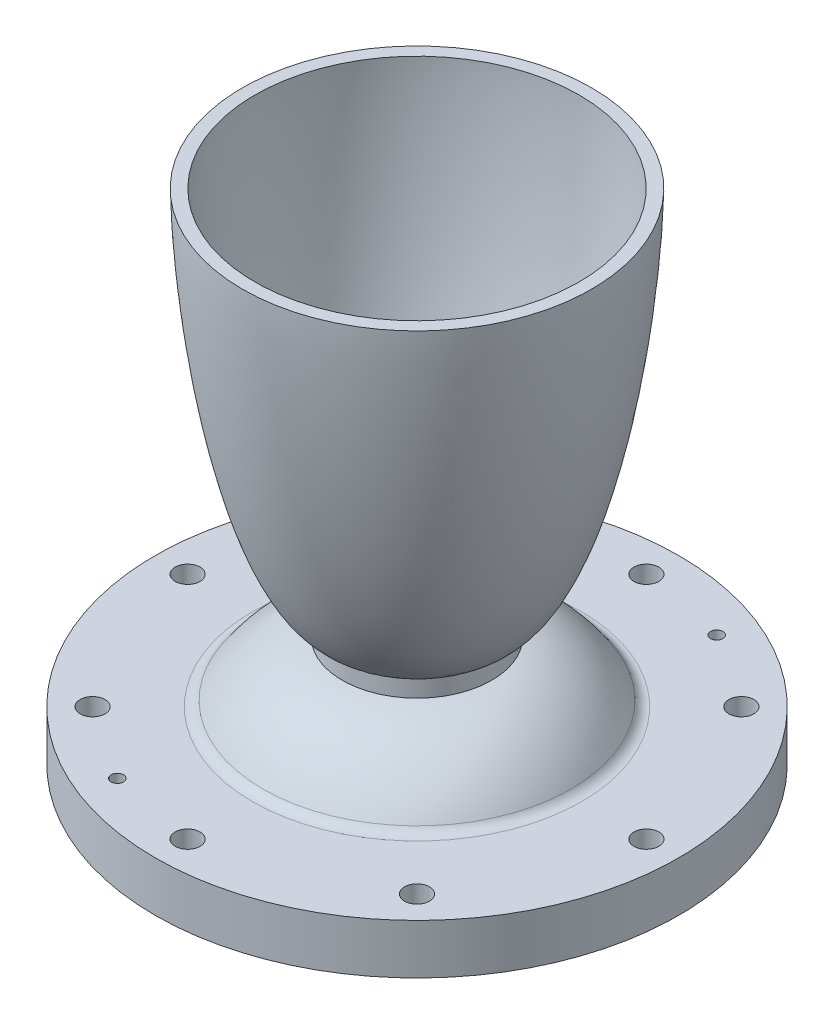
ISO-10303-21;
HEADER;
FILE_DESCRIPTION(('STEP AP214'),'2;1');
FILE_NAME('part.step','',(''),(''),'','','');
FILE_SCHEMA(('AUTOMOTIVE_DESIGN { 1 0 10303 214 1 1 1 1 }'));
ENDSEC;
DATA;
#1=APPLICATION_CONTEXT('core data for automotive mechanical design processes');
#2=APPLICATION_PROTOCOL_DEFINITION('international standard','automotive_design',2000,#1);
#3=PRODUCT_CONTEXT('',#1,'mechanical');
#4=PRODUCT('Part','Part','',(#3));
#5=PRODUCT_RELATED_PRODUCT_CATEGORY('part','',(#4));
#6=PRODUCT_DEFINITION_FORMATION('','',#4);
#7=PRODUCT_DEFINITION_CONTEXT('part definition',#1,'design');
#8=PRODUCT_DEFINITION('design','',#6,#7);
#9=PRODUCT_DEFINITION_SHAPE('','',#8);
#10=(LENGTH_UNIT() NAMED_UNIT(*) SI_UNIT(.MILLI.,.METRE.));
#11=(NAMED_UNIT(*) PLANE_ANGLE_UNIT() SI_UNIT($,.RADIAN.));
#12=(NAMED_UNIT(*) SI_UNIT($,.STERADIAN.) SOLID_ANGLE_UNIT());
#13=UNCERTAINTY_MEASURE_WITH_UNIT(LENGTH_MEASURE(1.E-05),#10,'distance_accuracy_value','');
#14=(GEOMETRIC_REPRESENTATION_CONTEXT(3) GLOBAL_UNCERTAINTY_ASSIGNED_CONTEXT((#13)) GLOBAL_UNIT_ASSIGNED_CONTEXT((#10,
#11,#12)) REPRESENTATION_CONTEXT('',''));
#15=CARTESIAN_POINT('',(0.,0.,0.));
#16=DIRECTION('',(0.,0.,1.));
#17=DIRECTION('',(1.,0.,0.));
#18=AXIS2_PLACEMENT_3D('',#15,#16,#17);
#19=CARTESIAN_POINT('',(0.,29.8542641397743,0.));
#20=DIRECTION('',(0.,-1.,0.));
#21=DIRECTION('',(0.,0.,-1.));
#22=AXIS2_PLACEMENT_3D('',#19,#20,#21);
#23=TOROIDAL_SURFACE('',#22,14.2803848547379,4.7625);
#24=CARTESIAN_POINT('',(0.,29.8542641397743,0.));
#25=DIRECTION('',(0.,-1.,0.));
#26=DIRECTION('',(0.,0.,-1.));
#27=AXIS2_PLACEMENT_3D('',#24,#25,#26);
#28=CIRCLE('',#27,9.51788485473788);
#29=CARTESIAN_POINT('',(0.,29.8542641397743,-9.51788485473788));
#30=VERTEX_POINT('',#29);
#31=EDGE_CURVE('E110',#30,#30,#28,.T.);
#32=ORIENTED_EDGE('',*,*,#31,.F.);
#33=EDGE_LOOP('',(#32));
#34=FACE_BOUND('',#33,.T.);
#35=CARTESIAN_POINT('',(0.,25.1315262063773,0.));
#36=DIRECTION('',(0.,-1.,0.));
#37=DIRECTION('',(0.,0.,-1.));
#38=AXIS2_PLACEMENT_3D('',#35,#36,#37);
#39=CIRCLE('',#38,13.666257288323);
#40=CARTESIAN_POINT('',(0.,25.1315262063773,-13.666257288323));
#41=VERTEX_POINT('',#40);
#42=EDGE_CURVE('E44',#41,#41,#39,.T.);
#43=ORIENTED_EDGE('',*,*,#42,.T.);
#44=EDGE_LOOP('',(#43));
#45=FACE_BOUND('',#44,.T.);
#46=ADVANCED_FACE('F31',(#34,#45),#23,.T.);
#47=CARTESIAN_POINT('',(-41.275,0.,0.));
#48=CARTESIAN_POINT('',(-41.2740482695217,0.0486337324386472,0.));
#49=CARTESIAN_POINT('',(-41.2702658160628,0.145822286289916,0.));
#50=CARTESIAN_POINT('',(-41.2498864286849,0.42069805070654,0.));
#51=CARTESIAN_POINT('',(-41.1844545380993,0.952068232417223,0.));
#52=CARTESIAN_POINT('',(-41.0456972319703,1.71822600495707,0.));
#53=CARTESIAN_POINT('',(-40.8030503882331,2.71061582436616,0.));
#54=CARTESIAN_POINT('',(-40.4713595142758,3.79591999168736,0.));
#55=CARTESIAN_POINT('',(-40.0738634411657,4.89282909417258,0.));
#56=CARTESIAN_POINT('',(-39.5825067896802,6.07481266261933,0.));
#57=CARTESIAN_POINT('',(-38.9093304891603,7.49520986042452,0.));
#58=CARTESIAN_POINT('',(-38.0131760324094,9.12980259281523,0.));
#59=CARTESIAN_POINT('',(-36.8509904587546,10.9460362971627,0.));
#60=CARTESIAN_POINT('',(-35.4547421274325,12.8169212480345,0.));
#61=CARTESIAN_POINT('',(-33.9314392187202,14.585782904275,0.));
#62=CARTESIAN_POINT('',(-32.2903839047085,16.2459191467967,0.));
#63=CARTESIAN_POINT('',(-30.5400711601419,17.790421622529,0.));
#64=CARTESIAN_POINT('',(-28.6887326358713,19.2122512067634,0.));
#65=CARTESIAN_POINT('',(-26.7445757643625,20.5043436040328,0.));
#66=CARTESIAN_POINT('',(-24.7162091347765,21.6597343307254,0.));
#67=CARTESIAN_POINT('',(-22.6125023398444,22.6717097728236,0.));
#68=CARTESIAN_POINT('',(-20.4432201113575,23.5339726344523,0.));
#69=CARTESIAN_POINT('',(-18.4962933476153,24.1524674664259,0.));
#70=CARTESIAN_POINT('',(-16.7998864552001,24.5823991503031,0.));
#71=CARTESIAN_POINT('',(-15.5134432636415,24.8436085254731,0.));
#72=CARTESIAN_POINT('',(-14.6581957403054,24.990901268989,0.));
#73=CARTESIAN_POINT('',(-14.0864515766681,25.0751975202173,0.));
#74=CARTESIAN_POINT('',(-13.8044042990146,25.1135620744107,0.));
#75=CARTESIAN_POINT('',(-13.666257288323,25.1315262063773,0.));
#76=B_SPLINE_CURVE_WITH_KNOTS('',4,(#47,#48,#49,#50,#51,#52,#53,#54,#55,#56,#57,#58,#59,#60,#61,
#62,#63,#64,#65,#66,#67,#68,#69,#70,#71,#72,#73,#74,#75),.UNSPECIFIED.,.F.,.F.,(5,1,1,1,1,1,1,1,
1,1,1,1,1,1,1,1,1,1,1,1,1,1,1,1,1,5),(0.,0.00401484909608226,0.00802969819216452,
0.0227470961228314,0.0441777122776176,0.0682473660350328,0.0923169269059589,0.116386462642345,
0.140456137271166,0.173883836801443,0.222022893633605,0.270162138141272,0.31830113459759,
0.366440286525089,0.414579370063091,0.462718532534819,0.510857613485277,0.558996754784725,
0.607135853792004,0.655274937644816,0.703414058846366,0.751553161907756,0.775622711242062,
0.799692260576367,0.811727036760595,0.823244081799249),.UNSPECIFIED.);
#77=CARTESIAN_POINT('',(0.,0.,0.));
#78=DIRECTION('',(0.,-1.,0.));
#79=AXIS1_PLACEMENT('',#77,#78);
#80=SURFACE_OF_REVOLUTION('',#76,#79);
#81=ORIENTED_EDGE('',*,*,#42,.F.);
#82=EDGE_LOOP('',(#81));
#83=FACE_BOUND('',#82,.T.);
#84=CARTESIAN_POINT('',(0.,0.,0.));
#85=DIRECTION('',(0.,-1.,0.));
#86=DIRECTION('',(0.,0.,-1.));
#87=AXIS2_PLACEMENT_3D('',#84,#85,#86);
#88=CIRCLE('',#87,41.275);
#89=CARTESIAN_POINT('',(0.,0.,-41.275));
#90=VERTEX_POINT('',#89);
#91=EDGE_CURVE('E177',#90,#90,#88,.T.);
#92=ORIENTED_EDGE('',*,*,#91,.T.);
#93=EDGE_LOOP('',(#92));
#94=FACE_BOUND('',#93,.T.);
#95=ADVANCED_FACE('F163',(#83,#94),#80,.T.);
#96=CARTESIAN_POINT('',(-41.275,0.,0.));
#97=DIRECTION('',(0.,1.,0.));
#98=DIRECTION('',(0.,0.,1.));
#99=AXIS2_PLACEMENT_3D('',#96,#97,#98);
#100=PLANE('',#99);
#101=CARTESIAN_POINT('',(22.3563661187686,0.,-53.9730422893094));
#102=DIRECTION('',(0.,-1.,0.));
#103=DIRECTION('',(0.,0.,-1.));
#104=AXIS2_PLACEMENT_3D('',#101,#102,#103);
#105=CIRCLE('',#104,3.17500000000001);
#106=CARTESIAN_POINT('',(22.3563661187686,0.,-57.1480422893094));
#107=VERTEX_POINT('',#106);
#108=EDGE_CURVE('E278',#107,#107,#105,.T.);
#109=ORIENTED_EDGE('',*,*,#108,.F.);
#110=EDGE_LOOP('',(#109));
#111=FACE_BOUND('',#110,.T.);
#112=CARTESIAN_POINT('',(-22.3563661187682,0.,53.9730422893095));
#113=DIRECTION('',(0.,-1.,0.));
#114=DIRECTION('',(0.,0.,-1.));
#115=AXIS2_PLACEMENT_3D('',#112,#113,#114);
#116=CIRCLE('',#115,3.17500000000001);
#117=CARTESIAN_POINT('',(-22.3563661187682,0.,50.7980422893095));
#118=VERTEX_POINT('',#117);
#119=EDGE_CURVE('E62',#118,#118,#116,.T.);
#120=ORIENTED_EDGE('',*,*,#119,.F.);
#121=EDGE_LOOP('',(#120));
#122=FACE_BOUND('',#121,.T.);
#123=CARTESIAN_POINT('',(-58.42,3.57353036051222E-13,0.));
#124=DIRECTION('',(0.,1.,0.));
#125=DIRECTION('',(0.,0.,1.));
#126=AXIS2_PLACEMENT_3D('',#123,#124,#125);
#127=CIRCLE('',#126,3.175);
#128=CARTESIAN_POINT('',(-58.42,3.57353036051222E-13,3.175));
#129=VERTEX_POINT('',#128);
#130=EDGE_CURVE('E54',#129,#129,#127,.T.);
#131=ORIENTED_EDGE('',*,*,#130,.T.);
#132=EDGE_LOOP('',(#131));
#133=FACE_BOUND('',#132,.T.);
#134=CARTESIAN_POINT('',(-41.309178156918,3.57353036051222E-13,-41.3091781569182));
#135=DIRECTION('',(0.,1.,0.));
#136=DIRECTION('',(0.,0.,1.));
#137=AXIS2_PLACEMENT_3D('',#134,#135,#136);
#138=CIRCLE('',#137,3.175);
#139=CARTESIAN_POINT('',(-41.309178156918,3.57353036051222E-13,-38.1341781569182));
#140=VERTEX_POINT('',#139);
#141=EDGE_CURVE('E71',#140,#140,#138,.T.);
#142=ORIENTED_EDGE('',*,*,#141,.T.);
#143=EDGE_LOOP('',(#142));
#144=FACE_BOUND('',#143,.T.);
#145=CARTESIAN_POINT('',(2.03972339815216E-13,3.57353036051222E-13,-58.42));
#146=DIRECTION('',(0.,1.,0.));
#147=DIRECTION('',(0.,0.,1.));
#148=AXIS2_PLACEMENT_3D('',#145,#146,#147);
#149=CIRCLE('',#148,3.175);
#150=CARTESIAN_POINT('',(2.03972339815216E-13,3.57353036051222E-13,-55.245));
#151=VERTEX_POINT('',#150);
#152=EDGE_CURVE('E77',#151,#151,#149,.T.);
#153=ORIENTED_EDGE('',*,*,#152,.T.);
#154=EDGE_LOOP('',(#153));
#155=FACE_BOUND('',#154,.T.);
#156=CARTESIAN_POINT('',(41.3091781569183,3.57353036051222E-13,-41.3091781569179));
#157=DIRECTION('',(0.,1.,0.));
#158=DIRECTION('',(0.,0.,1.));
#159=AXIS2_PLACEMENT_3D('',#156,#157,#158);
#160=CIRCLE('',#159,3.175);
#161=CARTESIAN_POINT('',(41.3091781569183,3.57353036051222E-13,-38.1341781569179));
#162=VERTEX_POINT('',#161);
#163=EDGE_CURVE('E83',#162,#162,#160,.T.);
#164=ORIENTED_EDGE('',*,*,#163,.T.);
#165=EDGE_LOOP('',(#164));
#166=FACE_BOUND('',#165,.T.);
#167=CARTESIAN_POINT('',(58.42,3.57353036051222E-13,4.07944679630432E-13));
#168=DIRECTION('',(0.,1.,0.));
#169=DIRECTION('',(0.,0.,1.));
#170=AXIS2_PLACEMENT_3D('',#167,#168,#169);
#171=CIRCLE('',#170,3.175);
#172=CARTESIAN_POINT('',(58.42,3.57353036051222E-13,3.17500000000041));
#173=VERTEX_POINT('',#172);
#174=EDGE_CURVE('E89',#173,#173,#171,.T.);
#175=ORIENTED_EDGE('',*,*,#174,.T.);
#176=EDGE_LOOP('',(#175));
#177=FACE_BOUND('',#176,.T.);
#178=CARTESIAN_POINT('',(41.3091781569178,3.57353036051222E-13,41.3091781569185));
#179=DIRECTION('',(0.,1.,0.));
#180=DIRECTION('',(0.,0.,1.));
#181=AXIS2_PLACEMENT_3D('',#178,#179,#180);
#182=CIRCLE('',#181,3.175);
#183=CARTESIAN_POINT('',(41.3091781569178,3.57353036051222E-13,44.4841781569185));
#184=VERTEX_POINT('',#183);
#185=EDGE_CURVE('E95',#184,#184,#182,.T.);
#186=ORIENTED_EDGE('',*,*,#185,.T.);
#187=EDGE_LOOP('',(#186));
#188=FACE_BOUND('',#187,.T.);
#189=CARTESIAN_POINT('',(-6.11917019445648E-13,3.57353036051222E-13,58.42));
#190=DIRECTION('',(0.,1.,0.));
#191=DIRECTION('',(0.,0.,1.));
#192=AXIS2_PLACEMENT_3D('',#189,#190,#191);
#193=CIRCLE('',#192,3.175);
#194=CARTESIAN_POINT('',(-6.11917019445648E-13,3.57353036051222E-13,61.595));
#195=VERTEX_POINT('',#194);
#196=EDGE_CURVE('E101',#195,#195,#193,.T.);
#197=ORIENTED_EDGE('',*,*,#196,.T.);
#198=EDGE_LOOP('',(#197));
#199=FACE_BOUND('',#198,.T.);
#200=CARTESIAN_POINT('',(-41.3091781569186,3.57353036051222E-13,41.3091781569176));
#201=DIRECTION('',(0.,1.,0.));
#202=DIRECTION('',(0.,0.,1.));
#203=AXIS2_PLACEMENT_3D('',#200,#201,#202);
#204=CIRCLE('',#203,3.175);
#205=CARTESIAN_POINT('',(-41.3091781569186,3.57353036051222E-13,44.4841781569176));
#206=VERTEX_POINT('',#205);
#207=EDGE_CURVE('E107',#206,#206,#204,.T.);
#208=ORIENTED_EDGE('',*,*,#207,.T.);
#209=EDGE_LOOP('',(#208));
#210=FACE_BOUND('',#209,.T.);
#211=ORIENTED_EDGE('',*,*,#91,.F.);
#212=EDGE_LOOP('',(#211));
#213=FACE_BOUND('',#212,.T.);
#214=CARTESIAN_POINT('',(0.,0.,0.));
#215=DIRECTION('',(0.,-1.,0.));
#216=DIRECTION('',(0.,0.,-1.));
#217=AXIS2_PLACEMENT_3D('',#214,#215,#216);
#218=CIRCLE('',#217,66.675);
#219=CARTESIAN_POINT('',(0.,0.,-66.675));
#220=VERTEX_POINT('',#219);
#221=EDGE_CURVE('E179',#220,#220,#218,.T.);
#222=ORIENTED_EDGE('',*,*,#221,.T.);
#223=EDGE_LOOP('',(#222));
#224=FACE_BOUND('',#223,.T.);
#225=ADVANCED_FACE('F166',(#111,#122,#133,#144,#155,#166,#177,#188,#199,#210,#213,#224),#100,.F.);
#226=CARTESIAN_POINT('',(0.,0.,0.));
#227=DIRECTION('',(0.,-1.,0.));
#228=DIRECTION('',(0.,0.,-1.));
#229=AXIS2_PLACEMENT_3D('',#226,#227,#228);
#230=CYLINDRICAL_SURFACE('',#229,66.675);
#231=ORIENTED_EDGE('',*,*,#221,.F.);
#232=EDGE_LOOP('',(#231));
#233=FACE_BOUND('',#232,.T.);
#234=CARTESIAN_POINT('',(0.,12.7,0.));
#235=DIRECTION('',(0.,-1.,0.));
#236=DIRECTION('',(0.,0.,-1.));
#237=AXIS2_PLACEMENT_3D('',#234,#235,#236);
#238=CIRCLE('',#237,66.675);
#239=CARTESIAN_POINT('',(0.,12.7,-66.675));
#240=VERTEX_POINT('',#239);
#241=EDGE_CURVE('E184',#240,#240,#238,.T.);
#242=ORIENTED_EDGE('',*,*,#241,.T.);
#243=EDGE_LOOP('',(#242));
#244=FACE_BOUND('',#243,.T.);
#245=ADVANCED_FACE('F293',(#233,#244),#230,.T.);
#246=CARTESIAN_POINT('',(-66.675,12.7000000000004,0.));
#247=DIRECTION('',(0.,-1.,0.));
#248=DIRECTION('',(0.,0.,-1.));
#249=AXIS2_PLACEMENT_3D('',#246,#247,#248);
#250=PLANE('',#249);
#251=CARTESIAN_POINT('',(22.3563661187686,12.7000000000004,-53.9730422893094));
#252=DIRECTION('',(0.,-1.,0.));
#253=DIRECTION('',(0.,0.,-1.));
#254=AXIS2_PLACEMENT_3D('',#251,#252,#253);
#255=CIRCLE('',#254,1.58750000000001);
#256=CARTESIAN_POINT('',(22.3563661187686,12.7000000000004,-55.5605422893094));
#257=VERTEX_POINT('',#256);
#258=EDGE_CURVE('E35',#257,#257,#255,.T.);
#259=ORIENTED_EDGE('',*,*,#258,.T.);
#260=EDGE_LOOP('',(#259));
#261=FACE_BOUND('',#260,.T.);
#262=CARTESIAN_POINT('',(-22.3563661187682,12.7000000000004,53.9730422893095));
#263=DIRECTION('',(0.,-1.,0.));
#264=DIRECTION('',(0.,0.,-1.));
#265=AXIS2_PLACEMENT_3D('',#262,#263,#264);
#266=CIRCLE('',#265,1.58750000000001);
#267=CARTESIAN_POINT('',(-22.3563661187682,12.7000000000004,52.3855422893095));
#268=VERTEX_POINT('',#267);
#269=EDGE_CURVE('E47',#268,#268,#266,.T.);
#270=ORIENTED_EDGE('',*,*,#269,.T.);
#271=EDGE_LOOP('',(#270));
#272=FACE_BOUND('',#271,.T.);
#273=CARTESIAN_POINT('',(-58.42,12.7000000000004,0.));
#274=DIRECTION('',(0.,1.,0.));
#275=DIRECTION('',(0.,0.,1.));
#276=AXIS2_PLACEMENT_3D('',#273,#274,#275);
#277=CIRCLE('',#276,3.175);
#278=CARTESIAN_POINT('',(-58.42,12.7000000000004,3.175));
#279=VERTEX_POINT('',#278);
#280=EDGE_CURVE('E49',#279,#279,#277,.T.);
#281=ORIENTED_EDGE('',*,*,#280,.F.);
#282=EDGE_LOOP('',(#281));
#283=FACE_BOUND('',#282,.T.);
#284=CARTESIAN_POINT('',(-41.309178156918,12.7000000000004,-41.3091781569182));
#285=DIRECTION('',(0.,1.,0.));
#286=DIRECTION('',(0.,0.,1.));
#287=AXIS2_PLACEMENT_3D('',#284,#285,#286);
#288=CIRCLE('',#287,3.175);
#289=CARTESIAN_POINT('',(-41.309178156918,12.7000000000004,-38.1341781569182));
#290=VERTEX_POINT('',#289);
#291=EDGE_CURVE('E68',#290,#290,#288,.T.);
#292=ORIENTED_EDGE('',*,*,#291,.F.);
#293=EDGE_LOOP('',(#292));
#294=FACE_BOUND('',#293,.T.);
#295=CARTESIAN_POINT('',(2.03972339815216E-13,12.7000000000004,-58.42));
#296=DIRECTION('',(0.,1.,0.));
#297=DIRECTION('',(0.,0.,1.));
#298=AXIS2_PLACEMENT_3D('',#295,#296,#297);
#299=CIRCLE('',#298,3.175);
#300=CARTESIAN_POINT('',(2.03972339815216E-13,12.7000000000004,-55.245));
#301=VERTEX_POINT('',#300);
#302=EDGE_CURVE('E74',#301,#301,#299,.T.);
#303=ORIENTED_EDGE('',*,*,#302,.F.);
#304=EDGE_LOOP('',(#303));
#305=FACE_BOUND('',#304,.T.);
#306=CARTESIAN_POINT('',(41.3091781569183,12.7000000000004,-41.3091781569179));
#307=DIRECTION('',(0.,1.,0.));
#308=DIRECTION('',(0.,0.,1.));
#309=AXIS2_PLACEMENT_3D('',#306,#307,#308);
#310=CIRCLE('',#309,3.175);
#311=CARTESIAN_POINT('',(41.3091781569183,12.7000000000004,-38.1341781569179));
#312=VERTEX_POINT('',#311);
#313=EDGE_CURVE('E80',#312,#312,#310,.T.);
#314=ORIENTED_EDGE('',*,*,#313,.F.);
#315=EDGE_LOOP('',(#314));
#316=FACE_BOUND('',#315,.T.);
#317=CARTESIAN_POINT('',(58.42,12.7000000000004,4.07944679630432E-13));
#318=DIRECTION('',(0.,1.,0.));
#319=DIRECTION('',(0.,0.,1.));
#320=AXIS2_PLACEMENT_3D('',#317,#318,#319);
#321=CIRCLE('',#320,3.175);
#322=CARTESIAN_POINT('',(58.42,12.7000000000004,3.17500000000041));
#323=VERTEX_POINT('',#322);
#324=EDGE_CURVE('E86',#323,#323,#321,.T.);
#325=ORIENTED_EDGE('',*,*,#324,.F.);
#326=EDGE_LOOP('',(#325));
#327=FACE_BOUND('',#326,.T.);
#328=CARTESIAN_POINT('',(41.3091781569178,12.7000000000004,41.3091781569185));
#329=DIRECTION('',(0.,1.,0.));
#330=DIRECTION('',(0.,0.,1.));
#331=AXIS2_PLACEMENT_3D('',#328,#329,#330);
#332=CIRCLE('',#331,3.175);
#333=CARTESIAN_POINT('',(41.3091781569178,12.7000000000004,44.4841781569185));
#334=VERTEX_POINT('',#333);
#335=EDGE_CURVE('E92',#334,#334,#332,.T.);
#336=ORIENTED_EDGE('',*,*,#335,.F.);
#337=EDGE_LOOP('',(#336));
#338=FACE_BOUND('',#337,.T.);
#339=CARTESIAN_POINT('',(-6.11917019445648E-13,12.7000000000004,58.42));
#340=DIRECTION('',(0.,1.,0.));
#341=DIRECTION('',(0.,0.,1.));
#342=AXIS2_PLACEMENT_3D('',#339,#340,#341);
#343=CIRCLE('',#342,3.175);
#344=CARTESIAN_POINT('',(-6.11917019445648E-13,12.7000000000004,61.595));
#345=VERTEX_POINT('',#344);
#346=EDGE_CURVE('E98',#345,#345,#343,.T.);
#347=ORIENTED_EDGE('',*,*,#346,.F.);
#348=EDGE_LOOP('',(#347));
#349=FACE_BOUND('',#348,.T.);
#350=CARTESIAN_POINT('',(-41.3091781569186,12.7000000000004,41.3091781569176));
#351=DIRECTION('',(0.,1.,0.));
#352=DIRECTION('',(0.,0.,1.));
#353=AXIS2_PLACEMENT_3D('',#350,#351,#352);
#354=CIRCLE('',#353,3.175);
#355=CARTESIAN_POINT('',(-41.3091781569186,12.7000000000004,44.4841781569176));
#356=VERTEX_POINT('',#355);
#357=EDGE_CURVE('E104',#356,#356,#354,.T.);
#358=ORIENTED_EDGE('',*,*,#357,.F.);
#359=EDGE_LOOP('',(#358));
#360=FACE_BOUND('',#359,.T.);
#361=CARTESIAN_POINT('',(0.,12.7000000000004,0.));
#362=DIRECTION('',(0.,-1.,0.));
#363=DIRECTION('',(0.,0.,-1.));
#364=AXIS2_PLACEMENT_3D('',#361,#362,#363);
#365=CIRCLE('',#364,41.9101087470733);
#366=CARTESIAN_POINT('',(0.,12.7000000000004,-41.9101087470733));
#367=VERTEX_POINT('',#366);
#368=EDGE_CURVE('E39',#367,#367,#365,.T.);
#369=ORIENTED_EDGE('',*,*,#368,.T.);
#370=EDGE_LOOP('',(#369));
#371=FACE_BOUND('',#370,.T.);
#372=ORIENTED_EDGE('',*,*,#241,.F.);
#373=EDGE_LOOP('',(#372));
#374=FACE_BOUND('',#373,.T.);
#375=ADVANCED_FACE('F145',(#261,#272,#283,#294,#305,#316,#327,#338,#349,#360,#371,#374),#250,.F.);
#376=CARTESIAN_POINT('',(-19.0499551814362,28.0417533207216,0.));
#377=CARTESIAN_POINT('',(-19.1069117009484,28.0339929624486,0.));
#378=CARTESIAN_POINT('',(-19.2603203610073,28.0123784889566,0.));
#379=CARTESIAN_POINT('',(-19.6297763228578,27.9577569387192,0.));
#380=CARTESIAN_POINT('',(-19.9867418472325,27.8961572315741,0.));
#381=CARTESIAN_POINT('',(-20.4682482475525,27.8070883105186,0.));
#382=CARTESIAN_POINT('',(-21.0210322533182,27.6912291497683,0.));
#383=CARTESIAN_POINT('',(-21.7046020879631,27.5316180661186,0.));
#384=CARTESIAN_POINT('',(-22.4814188904759,27.3225150658657,0.));
#385=CARTESIAN_POINT('',(-23.3684385542744,27.0490080911653,0.));
#386=CARTESIAN_POINT('',(-24.2399754873252,26.7436801958539,0.));
#387=CARTESIAN_POINT('',(-25.1026039793356,26.4064155372752,0.));
#388=CARTESIAN_POINT('',(-25.9509498639137,26.0387893885073,0.));
#389=CARTESIAN_POINT('',(-26.7868614636742,25.6414396059053,0.));
#390=CARTESIAN_POINT('',(-27.6079687471209,25.2156201275244,0.));
#391=CARTESIAN_POINT('',(-28.4145773827156,24.7622397095165,0.));
#392=CARTESIAN_POINT('',(-29.2055059219226,24.2824363012087,0.));
#393=CARTESIAN_POINT('',(-30.1509531047983,23.6661336342614,0.));
#394=CARTESIAN_POINT('',(-31.0703519617172,23.0114171122437,0.));
#395=CARTESIAN_POINT('',(-31.9629672732926,22.3205429268385,0.));
#396=CARTESIAN_POINT('',(-32.8279520519508,21.5958186226853,0.));
#397=CARTESIAN_POINT('',(-33.5193731136121,20.981085311517,0.));
#398=CARTESIAN_POINT('',(-34.1927341805538,20.346852672164,0.));
#399=CARTESIAN_POINT('',(-34.8480617268935,19.6936497535157,0.));
#400=CARTESIAN_POINT('',(-35.4848195085175,19.0229190171889,0.));
#401=CARTESIAN_POINT('',(-36.1034345037768,18.3344816465724,0.));
#402=CARTESIAN_POINT('',(-36.7027962589045,17.6307659590695,0.));
#403=CARTESIAN_POINT('',(-37.284399500345,16.9097142340408,0.));
#404=CARTESIAN_POINT('',(-37.7750992899675,16.2686189878945,0.));
#405=CARTESIAN_POINT('',(-38.1863532688737,15.7058301022558,0.));
#406=CARTESIAN_POINT('',(-38.5835491508499,15.1438785046549,0.));
#407=CARTESIAN_POINT('',(-38.9146241036099,14.6560837982546,0.));
#408=CARTESIAN_POINT('',(-39.2216518368004,14.1903688819877,0.));
#409=CARTESIAN_POINT('',(-39.5463645590003,13.6750708703195,0.));
#410=CARTESIAN_POINT('',(-39.7598086387543,13.330999270967,0.));
#411=CARTESIAN_POINT('',(-39.9832651031548,12.9554014563824,0.));
#412=CARTESIAN_POINT('',(-40.083978858077,12.7841562616043,0.));
#413=CARTESIAN_POINT('',(-40.1329288445659,12.7000000000007,0.));
#414=B_SPLINE_CURVE_WITH_KNOTS('',4,(#376,#377,#378,#379,#380,#381,#382,#383,#384,#385,#386,
#387,#388,#389,#390,#391,#392,#393,#394,#395,#396,#397,#398,#399,#400,#401,#402,#403,#404,#405,
#406,#407,#408,#409,#410,#411,#412,#413),.UNSPECIFIED.,.F.,.F.,(5,1,1,1,1,1,1,1,1,1,1,1,1,1,1,1,
1,1,1,1,1,1,1,1,1,1,1,1,1,1,1,1,1,1,5),(0.0737864846089589,0.0823067873975031,
0.0967373895733721,0.111167991749241,0.125598594020719,0.140029196292197,0.168890402562911,
0.197751611567369,0.226612819724607,0.255474024473066,0.284335229890395,0.313196438605301,
0.342057647426624,0.370918856138996,0.399780065184687,0.428641273178825,0.457502483533366,
0.511742466817527,0.540603676265201,0.569464885712874,0.598326094356537,0.627187303000199,
0.656048506911727,0.684909710823255,0.713770922697728,0.742632134572201,0.771493345751176,
0.800354556930151,0.814785154803573,0.829215752676995,0.858076948423839,0.872507548139599,
0.886938147855359,0.901368747571118,0.915799347286878),.UNSPECIFIED.);
#415=CARTESIAN_POINT('',(0.,0.,0.));
#416=DIRECTION('',(0.,-1.,0.));
#417=AXIS1_PLACEMENT('',#415,#416);
#418=SURFACE_OF_REVOLUTION('',#414,#417);
#419=CARTESIAN_POINT('',(0.,14.1554481777137,0.));
#420=DIRECTION('',(0.,-1.,0.));
#421=DIRECTION('',(0.,0.,-1.));
#422=AXIS2_PLACEMENT_3D('',#419,#420,#421);
#423=CIRCLE('',#422,39.2410702440781);
#424=CARTESIAN_POINT('',(0.,14.1554481777137,-39.2410702440781));
#425=VERTEX_POINT('',#424);
#426=EDGE_CURVE('E10',#425,#425,#423,.F.);
#427=ORIENTED_EDGE('',*,*,#426,.T.);
#428=EDGE_LOOP('',(#427));
#429=FACE_BOUND('',#428,.T.);
#430=CARTESIAN_POINT('',(0.,28.0417533207223,0.));
#431=DIRECTION('',(0.,-1.,0.));
#432=DIRECTION('',(0.,0.,-1.));
#433=AXIS2_PLACEMENT_3D('',#430,#431,#432);
#434=CIRCLE('',#433,19.0499551814364);
#435=CARTESIAN_POINT('',(0.,28.0417533207223,-19.0499551814364));
#436=VERTEX_POINT('',#435);
#437=EDGE_CURVE('E187',#436,#436,#434,.T.);
#438=ORIENTED_EDGE('',*,*,#437,.T.);
#439=EDGE_LOOP('',(#438));
#440=FACE_BOUND('',#439,.T.);
#441=ADVANCED_FACE('F141',(#429,#440),#418,.T.);
#442=CARTESIAN_POINT('',(0.,32.477251840364,0.));
#443=DIRECTION('',(0.,1.,0.));
#444=DIRECTION('',(0.,0.,1.));
#445=AXIS2_PLACEMENT_3D('',#442,#443,#444);
#446=CONICAL_SURFACE('',#445,19.0500000000192,1.01045198523843E-05);
#447=ORIENTED_EDGE('',*,*,#437,.F.);
#448=EDGE_LOOP('',(#447));
#449=FACE_BOUND('',#448,.T.);
#450=CARTESIAN_POINT('',(0.,32.477251840364,0.));
#451=DIRECTION('',(0.,-1.,0.));
#452=DIRECTION('',(0.,0.,-1.));
#453=AXIS2_PLACEMENT_3D('',#450,#451,#452);
#454=CIRCLE('',#453,19.0500000000192);
#455=CARTESIAN_POINT('',(0.,32.477251840364,-19.0500000000192));
#456=VERTEX_POINT('',#455);
#457=EDGE_CURVE('E190',#456,#456,#454,.T.);
#458=ORIENTED_EDGE('',*,*,#457,.T.);
#459=EDGE_LOOP('',(#458));
#460=FACE_BOUND('',#459,.T.);
#461=ADVANCED_FACE('F137',(#449,#460),#446,.T.);
#462=CARTESIAN_POINT('',(-44.4499999994619,127.,0.));
#463=CARTESIAN_POINT('',(-44.4440480949627,126.089867785625,0.));
#464=CARTESIAN_POINT('',(-44.3997234937456,124.270031310633,0.));
#465=CARTESIAN_POINT('',(-44.2561708348068,120.604636061883,0.));
#466=CARTESIAN_POINT('',(-43.9212069727933,115.098603124568,0.));
#467=CARTESIAN_POINT('',(-43.3950463606768,108.666141992639,0.));
#468=CARTESIAN_POINT('',(-42.6246446121031,101.314791697914,0.));
#469=CARTESIAN_POINT('',(-41.6911594682795,93.9823600996109,0.));
#470=CARTESIAN_POINT('',(-40.5889041011441,86.6733392574783,0.));
#471=CARTESIAN_POINT('',(-39.3055204834889,79.3937386890904,0.));
#472=CARTESIAN_POINT('',(-37.8196170375013,72.152599105172,0.));
#473=CARTESIAN_POINT('',(-36.0988903282507,64.9630070237046,0.));
#474=CARTESIAN_POINT('',(-34.092981801623,57.8470820320063,0.));
#475=CARTESIAN_POINT('',(-31.7661981405824,50.9720173809853,0.));
#476=CARTESIAN_POINT('',(-29.3150373471858,45.1286490762413,0.));
#477=CARTESIAN_POINT('',(-26.8381389868326,40.4693278183936,0.));
#478=CARTESIAN_POINT('',(-24.5703302650785,37.1782514550421,0.));
#479=CARTESIAN_POINT('',(-22.7831204154743,35.1329736574909,0.));
#480=CARTESIAN_POINT('',(-21.3073007985053,33.8364878019842,0.));
#481=CARTESIAN_POINT('',(-20.194653885228,33.0747827719268,0.));
#482=CARTESIAN_POINT('',(-19.5152952812364,32.7004663944373,0.));
#483=CARTESIAN_POINT('',(-19.2057724197125,32.548791320822,0.));
#484=CARTESIAN_POINT('',(-19.0500000000192,32.477251840364,0.));
#485=B_SPLINE_CURVE_WITH_KNOTS('',4,(#462,#463,#464,#465,#466,#467,#468,#469,#470,#471,#472,
#473,#474,#475,#476,#477,#478,#479,#480,#481,#482,#483,#484),.UNSPECIFIED.,.F.,.F.,(5,1,1,1,1,1,
1,1,1,1,1,1,1,1,1,1,1,1,1,5),(0.,0.0331608081218559,0.0663216162437117,0.13364469557757,
0.200967790308634,0.268290787447395,0.33561384231508,0.402936930100839,0.470260007312255,
0.537583094276509,0.60490613878835,0.672229114484928,0.739552316261651,0.801869766015148,
0.835531618042228,0.864104380029788,0.884897619658436,0.900577549119469,0.906888404227075,
0.913134212312117),.UNSPECIFIED.);
#486=CARTESIAN_POINT('',(0.,0.,0.));
#487=DIRECTION('',(0.,-1.,0.));
#488=AXIS1_PLACEMENT('',#486,#487);
#489=SURFACE_OF_REVOLUTION('',#485,#488);
#490=ORIENTED_EDGE('',*,*,#457,.F.);
#491=EDGE_LOOP('',(#490));
#492=FACE_BOUND('',#491,.T.);
#493=CARTESIAN_POINT('',(0.,127.,0.));
#494=DIRECTION('',(0.,-1.,0.));
#495=DIRECTION('',(0.,0.,-1.));
#496=AXIS2_PLACEMENT_3D('',#493,#494,#495);
#497=CIRCLE('',#496,44.449999999462);
#498=CARTESIAN_POINT('',(0.,127.,-44.449999999462));
#499=VERTEX_POINT('',#498);
#500=EDGE_CURVE('E193',#499,#499,#497,.T.);
#501=ORIENTED_EDGE('',*,*,#500,.T.);
#502=EDGE_LOOP('',(#501));
#503=FACE_BOUND('',#502,.T.);
#504=ADVANCED_FACE('F133',(#492,#503),#489,.T.);
#505=CARTESIAN_POINT('',(-44.449999999462,127.,0.));
#506=DIRECTION('',(0.,-1.,0.));
#507=DIRECTION('',(0.,0.,-1.));
#508=AXIS2_PLACEMENT_3D('',#505,#506,#507);
#509=PLANE('',#508);
#510=ORIENTED_EDGE('',*,*,#500,.F.);
#511=EDGE_LOOP('',(#510));
#512=FACE_BOUND('',#511,.T.);
#513=CARTESIAN_POINT('',(0.,127.,0.));
#514=DIRECTION('',(0.,-1.,0.));
#515=DIRECTION('',(0.,0.,-1.));
#516=AXIS2_PLACEMENT_3D('',#513,#514,#515);
#517=CIRCLE('',#516,41.275);
#518=CARTESIAN_POINT('',(0.,127.,-41.275));
#519=VERTEX_POINT('',#518);
#520=EDGE_CURVE('E196',#519,#519,#517,.T.);
#521=ORIENTED_EDGE('',*,*,#520,.T.);
#522=EDGE_LOOP('',(#521));
#523=FACE_BOUND('',#522,.T.);
#524=ADVANCED_FACE('F128',(#512,#523),#509,.F.);
#525=CARTESIAN_POINT('',(-12.6773409556318,35.4889198187523,0.));
#526=CARTESIAN_POINT('',(-12.7732848592656,35.5232154561329,0.));
#527=CARTESIAN_POINT('',(-13.0375647621944,35.6215562004272,0.));
#528=CARTESIAN_POINT('',(-13.4647754627408,35.797858298487,0.));
#529=CARTESIAN_POINT('',(-14.0774164435609,36.0904916639894,0.));
#530=CARTESIAN_POINT('',(-14.7707294102384,36.4765377319897,0.));
#531=CARTESIAN_POINT('',(-15.7468622587249,37.1002174776773,0.));
#532=CARTESIAN_POINT('',(-17.0528319827198,38.1035395787502,0.));
#533=CARTESIAN_POINT('',(-18.7203178430293,39.6859165032633,0.));
#534=CARTESIAN_POINT('',(-20.7112098452496,42.0554981742865,0.));
#535=CARTESIAN_POINT('',(-23.1258342222305,45.5925436415,0.));
#536=CARTESIAN_POINT('',(-25.6831407827854,50.291800129597,0.));
#537=CARTESIAN_POINT('',(-28.1912692207761,55.9763831267094,0.));
#538=CARTESIAN_POINT('',(-30.5585169708021,62.4907579566963,0.));
#539=CARTESIAN_POINT('',(-32.5938073550281,69.1145502440156,0.));
#540=CARTESIAN_POINT('',(-34.3591237402991,75.8147735578479,0.));
#541=CARTESIAN_POINT('',(-35.8956312407358,82.5706199688914,0.));
#542=CARTESIAN_POINT('',(-37.2305702212177,89.368983138702,0.));
#543=CARTESIAN_POINT('',(-38.3822278625073,96.2006167737801,0.));
#544=CARTESIAN_POINT('',(-39.3608494636477,103.05910618467,0.));
#545=CARTESIAN_POINT('',(-40.1704674223054,109.939618965182,0.));
#546=CARTESIAN_POINT('',(-40.7227860846152,115.949040077317,0.));
#547=CARTESIAN_POINT('',(-41.0733691261886,121.078528781532,0.));
#548=CARTESIAN_POINT('',(-41.2229977057739,124.484568363418,0.));
#549=CARTESIAN_POINT('',(-41.2688730363136,126.161357832939,0.));
#550=CARTESIAN_POINT('',(-41.275,127.,0.));
#551=B_SPLINE_CURVE_WITH_KNOTS('',4,(#525,#526,#527,#528,#529,#530,#531,#532,#533,#534,#535,
#536,#537,#538,#539,#540,#541,#542,#543,#544,#545,#546,#547,#548,#549,#550),.UNSPECIFIED.,.F.,
.F.,(5,1,1,1,1,1,1,1,1,1,1,1,1,1,1,1,1,1,1,1,1,1,5),(0.,0.00374307995331247,0.0103584655181561,
0.0169738510829998,0.0249271942175395,0.0328805373520792,0.0528892136881201,0.0773816429618902,
0.10919472490756,0.146374270074533,0.210001175516254,0.273627892657264,0.337254754330257,
0.400881621075781,0.464508471937456,0.528135328570352,0.591762176390416,0.655389059707643,
0.719015710883957,0.782642537527227,0.84626947354136,0.877081130050798,0.907892786560235),.UNSPECIFIED.);
#552=CARTESIAN_POINT('',(0.,0.,0.));
#553=DIRECTION('',(0.,-1.,0.));
#554=AXIS1_PLACEMENT('',#552,#553);
#555=SURFACE_OF_REVOLUTION('',#551,#554);
#556=ORIENTED_EDGE('',*,*,#520,.F.);
#557=EDGE_LOOP('',(#556));
#558=FACE_BOUND('',#557,.T.);
#559=CARTESIAN_POINT('',(0.,35.4889198187522,0.));
#560=DIRECTION('',(0.,-1.,0.));
#561=DIRECTION('',(0.,0.,-1.));
#562=AXIS2_PLACEMENT_3D('',#559,#560,#561);
#563=CIRCLE('',#562,12.6773409556317);
#564=CARTESIAN_POINT('',(0.,35.4889198187522,-12.6773409556317));
#565=VERTEX_POINT('',#564);
#566=EDGE_CURVE('E199',#565,#565,#563,.T.);
#567=ORIENTED_EDGE('',*,*,#566,.T.);
#568=EDGE_LOOP('',(#567));
#569=FACE_BOUND('',#568,.T.);
#570=ADVANCED_FACE('F123',(#558,#569),#555,.T.);
#571=CARTESIAN_POINT('',(0.,31.0043176616441,0.));
#572=DIRECTION('',(0.,-1.,0.));
#573=DIRECTION('',(0.,0.,-1.));
#574=AXIS2_PLACEMENT_3D('',#571,#572,#573);
#575=TOROIDAL_SURFACE('',#574,14.2803848547379,4.76250000000001);
#576=ORIENTED_EDGE('',*,*,#566,.F.);
#577=EDGE_LOOP('',(#576));
#578=FACE_BOUND('',#577,.T.);
#579=CARTESIAN_POINT('',(0.,31.0043176616441,0.));
#580=DIRECTION('',(0.,-1.,0.));
#581=DIRECTION('',(0.,0.,-1.));
#582=AXIS2_PLACEMENT_3D('',#579,#580,#581);
#583=CIRCLE('',#582,9.51788485473788);
#584=CARTESIAN_POINT('',(0.,31.0043176616441,-9.51788485473788));
#585=VERTEX_POINT('',#584);
#586=EDGE_CURVE('E201',#585,#585,#583,.T.);
#587=ORIENTED_EDGE('',*,*,#586,.T.);
#588=EDGE_LOOP('',(#587));
#589=FACE_BOUND('',#588,.T.);
#590=ADVANCED_FACE('F127',(#578,#589),#575,.T.);
#591=CARTESIAN_POINT('',(0.,0.,0.));
#592=DIRECTION('',(0.,-1.,0.));
#593=DIRECTION('',(0.,0.,-1.));
#594=AXIS2_PLACEMENT_3D('',#591,#592,#593);
#595=CYLINDRICAL_SURFACE('',#594,9.51788485473788);
#596=ORIENTED_EDGE('',*,*,#586,.F.);
#597=EDGE_LOOP('',(#596));
#598=FACE_BOUND('',#597,.T.);
#599=ORIENTED_EDGE('',*,*,#31,.T.);
#600=EDGE_LOOP('',(#599));
#601=FACE_BOUND('',#600,.T.);
#602=ADVANCED_FACE('F206',(#598,#601),#595,.F.);
#603=CARTESIAN_POINT('',(0.,15.8750000000004,0.));
#604=DIRECTION('',(0.,-1.,0.));
#605=DIRECTION('',(0.,0.,-1.));
#606=AXIS2_PLACEMENT_3D('',#603,#604,#605);
#607=TOROIDAL_SURFACE('',#606,41.9101087470733,3.175);
#608=ORIENTED_EDGE('',*,*,#426,.F.);
#609=EDGE_LOOP('',(#608));
#610=FACE_BOUND('',#609,.T.);
#611=ORIENTED_EDGE('',*,*,#368,.F.);
#612=EDGE_LOOP('',(#611));
#613=FACE_BOUND('',#612,.T.);
#614=ADVANCED_FACE('F33',(#610,#613),#607,.F.);
#615=CARTESIAN_POINT('',(-41.3091781569186,12.7000000000004,41.3091781569176));
#616=DIRECTION('',(0.,1.,0.));
#617=DIRECTION('',(0.,0.,1.));
#618=AXIS2_PLACEMENT_3D('',#615,#616,#617);
#619=CYLINDRICAL_SURFACE('',#618,3.175);
#620=ORIENTED_EDGE('',*,*,#207,.F.);
#621=EDGE_LOOP('',(#620));
#622=FACE_BOUND('',#621,.T.);
#623=ORIENTED_EDGE('',*,*,#357,.T.);
#624=EDGE_LOOP('',(#623));
#625=FACE_BOUND('',#624,.T.);
#626=ADVANCED_FACE('F213',(#622,#625),#619,.F.);
#627=CARTESIAN_POINT('',(-6.11917019445648E-13,12.7000000000004,58.42));
#628=DIRECTION('',(0.,1.,0.));
#629=DIRECTION('',(0.,0.,1.));
#630=AXIS2_PLACEMENT_3D('',#627,#628,#629);
#631=CYLINDRICAL_SURFACE('',#630,3.175);
#632=ORIENTED_EDGE('',*,*,#196,.F.);
#633=EDGE_LOOP('',(#632));
#634=FACE_BOUND('',#633,.T.);
#635=ORIENTED_EDGE('',*,*,#346,.T.);
#636=EDGE_LOOP('',(#635));
#637=FACE_BOUND('',#636,.T.);
#638=ADVANCED_FACE('F219',(#634,#637),#631,.F.);
#639=CARTESIAN_POINT('',(41.3091781569178,12.7000000000004,41.3091781569185));
#640=DIRECTION('',(0.,1.,0.));
#641=DIRECTION('',(0.,0.,1.));
#642=AXIS2_PLACEMENT_3D('',#639,#640,#641);
#643=CYLINDRICAL_SURFACE('',#642,3.175);
#644=ORIENTED_EDGE('',*,*,#185,.F.);
#645=EDGE_LOOP('',(#644));
#646=FACE_BOUND('',#645,.T.);
#647=ORIENTED_EDGE('',*,*,#335,.T.);
#648=EDGE_LOOP('',(#647));
#649=FACE_BOUND('',#648,.T.);
#650=ADVANCED_FACE('F223',(#646,#649),#643,.F.);
#651=CARTESIAN_POINT('',(58.42,12.7000000000004,4.07944679630432E-13));
#652=DIRECTION('',(0.,1.,0.));
#653=DIRECTION('',(0.,0.,1.));
#654=AXIS2_PLACEMENT_3D('',#651,#652,#653);
#655=CYLINDRICAL_SURFACE('',#654,3.175);
#656=ORIENTED_EDGE('',*,*,#174,.F.);
#657=EDGE_LOOP('',(#656));
#658=FACE_BOUND('',#657,.T.);
#659=ORIENTED_EDGE('',*,*,#324,.T.);
#660=EDGE_LOOP('',(#659));
#661=FACE_BOUND('',#660,.T.);
#662=ADVANCED_FACE('F227',(#658,#661),#655,.F.);
#663=CARTESIAN_POINT('',(41.3091781569183,12.7000000000004,-41.3091781569179));
#664=DIRECTION('',(0.,1.,0.));
#665=DIRECTION('',(0.,0.,1.));
#666=AXIS2_PLACEMENT_3D('',#663,#664,#665);
#667=CYLINDRICAL_SURFACE('',#666,3.175);
#668=ORIENTED_EDGE('',*,*,#163,.F.);
#669=EDGE_LOOP('',(#668));
#670=FACE_BOUND('',#669,.T.);
#671=ORIENTED_EDGE('',*,*,#313,.T.);
#672=EDGE_LOOP('',(#671));
#673=FACE_BOUND('',#672,.T.);
#674=ADVANCED_FACE('F231',(#670,#673),#667,.F.);
#675=CARTESIAN_POINT('',(2.03972339815216E-13,12.7000000000004,-58.42));
#676=DIRECTION('',(0.,1.,0.));
#677=DIRECTION('',(0.,0.,1.));
#678=AXIS2_PLACEMENT_3D('',#675,#676,#677);
#679=CYLINDRICAL_SURFACE('',#678,3.175);
#680=ORIENTED_EDGE('',*,*,#152,.F.);
#681=EDGE_LOOP('',(#680));
#682=FACE_BOUND('',#681,.T.);
#683=ORIENTED_EDGE('',*,*,#302,.T.);
#684=EDGE_LOOP('',(#683));
#685=FACE_BOUND('',#684,.T.);
#686=ADVANCED_FACE('F235',(#682,#685),#679,.F.);
#687=CARTESIAN_POINT('',(-41.309178156918,12.7000000000004,-41.3091781569182));
#688=DIRECTION('',(0.,1.,0.));
#689=DIRECTION('',(0.,0.,1.));
#690=AXIS2_PLACEMENT_3D('',#687,#688,#689);
#691=CYLINDRICAL_SURFACE('',#690,3.175);
#692=ORIENTED_EDGE('',*,*,#141,.F.);
#693=EDGE_LOOP('',(#692));
#694=FACE_BOUND('',#693,.T.);
#695=ORIENTED_EDGE('',*,*,#291,.T.);
#696=EDGE_LOOP('',(#695));
#697=FACE_BOUND('',#696,.T.);
#698=ADVANCED_FACE('F239',(#694,#697),#691,.F.);
#699=CARTESIAN_POINT('',(-58.42,12.7000000000004,0.));
#700=DIRECTION('',(0.,1.,0.));
#701=DIRECTION('',(0.,0.,1.));
#702=AXIS2_PLACEMENT_3D('',#699,#700,#701);
#703=CYLINDRICAL_SURFACE('',#702,3.175);
#704=ORIENTED_EDGE('',*,*,#130,.F.);
#705=EDGE_LOOP('',(#704));
#706=FACE_BOUND('',#705,.T.);
#707=ORIENTED_EDGE('',*,*,#280,.T.);
#708=EDGE_LOOP('',(#707));
#709=FACE_BOUND('',#708,.T.);
#710=ADVANCED_FACE('F243',(#706,#709),#703,.F.);
#711=CARTESIAN_POINT('',(-22.3563661187682,0.,53.9730422893095));
#712=DIRECTION('',(0.,-1.,0.));
#713=DIRECTION('',(0.,0.,-1.));
#714=AXIS2_PLACEMENT_3D('',#711,#712,#713);
#715=CYLINDRICAL_SURFACE('',#714,1.58750000000001);
#716=CARTESIAN_POINT('',(-22.3563661187682,6.35,53.9730422893095));
#717=DIRECTION('',(0.,-1.,0.));
#718=DIRECTION('',(0.,0.,-1.));
#719=AXIS2_PLACEMENT_3D('',#716,#717,#718);
#720=CIRCLE('',#719,1.58750000000001);
#721=CARTESIAN_POINT('',(-22.3563661187682,6.35,52.3855422893095));
#722=VERTEX_POINT('',#721);
#723=EDGE_CURVE('E50',#722,#722,#720,.T.);
#724=ORIENTED_EDGE('',*,*,#723,.T.);
#725=EDGE_LOOP('',(#724));
#726=FACE_BOUND('',#725,.T.);
#727=ORIENTED_EDGE('',*,*,#269,.F.);
#728=EDGE_LOOP('',(#727));
#729=FACE_BOUND('',#728,.T.);
#730=ADVANCED_FACE('F247',(#726,#729),#715,.F.);
#731=CARTESIAN_POINT('',(-20.7688661187682,6.35,53.9730422893095));
#732=DIRECTION('',(0.,1.,0.));
#733=DIRECTION('',(0.,0.,1.));
#734=AXIS2_PLACEMENT_3D('',#731,#732,#733);
#735=PLANE('',#734);
#736=ORIENTED_EDGE('',*,*,#723,.F.);
#737=EDGE_LOOP('',(#736));
#738=FACE_BOUND('',#737,.T.);
#739=CARTESIAN_POINT('',(-22.3563661187682,6.35,53.9730422893095));
#740=DIRECTION('',(0.,-1.,0.));
#741=DIRECTION('',(0.,0.,-1.));
#742=AXIS2_PLACEMENT_3D('',#739,#740,#741);
#743=CIRCLE('',#742,3.17500000000001);
#744=CARTESIAN_POINT('',(-22.3563661187682,6.35,50.7980422893095));
#745=VERTEX_POINT('',#744);
#746=EDGE_CURVE('E57',#745,#745,#743,.T.);
#747=ORIENTED_EDGE('',*,*,#746,.T.);
#748=EDGE_LOOP('',(#747));
#749=FACE_BOUND('',#748,.T.);
#750=ADVANCED_FACE('F251',(#738,#749),#735,.F.);
#751=CARTESIAN_POINT('',(-22.3563661187682,0.,53.9730422893095));
#752=DIRECTION('',(0.,-1.,0.));
#753=DIRECTION('',(0.,0.,-1.));
#754=AXIS2_PLACEMENT_3D('',#751,#752,#753);
#755=CYLINDRICAL_SURFACE('',#754,3.17500000000001);
#756=ORIENTED_EDGE('',*,*,#746,.F.);
#757=EDGE_LOOP('',(#756));
#758=FACE_BOUND('',#757,.T.);
#759=ORIENTED_EDGE('',*,*,#119,.T.);
#760=EDGE_LOOP('',(#759));
#761=FACE_BOUND('',#760,.T.);
#762=ADVANCED_FACE('F254',(#758,#761),#755,.F.);
#763=CARTESIAN_POINT('',(22.3563661187686,0.,-53.9730422893094));
#764=DIRECTION('',(0.,-1.,0.));
#765=DIRECTION('',(0.,0.,-1.));
#766=AXIS2_PLACEMENT_3D('',#763,#764,#765);
#767=CYLINDRICAL_SURFACE('',#766,1.58750000000001);
#768=CARTESIAN_POINT('',(22.3563661187686,6.35,-53.9730422893094));
#769=DIRECTION('',(0.,-1.,0.));
#770=DIRECTION('',(0.,0.,-1.));
#771=AXIS2_PLACEMENT_3D('',#768,#769,#770);
#772=CIRCLE('',#771,1.58750000000002);
#773=CARTESIAN_POINT('',(22.3563661187686,6.35,-55.5605422893094));
#774=VERTEX_POINT('',#773);
#775=EDGE_CURVE('E281',#774,#774,#772,.T.);
#776=ORIENTED_EDGE('',*,*,#775,.T.);
#777=EDGE_LOOP('',(#776));
#778=FACE_BOUND('',#777,.T.);
#779=ORIENTED_EDGE('',*,*,#258,.F.);
#780=EDGE_LOOP('',(#779));
#781=FACE_BOUND('',#780,.T.);
#782=ADVANCED_FACE('F258',(#778,#781),#767,.F.);
#783=CARTESIAN_POINT('',(23.9438661187686,6.35,-53.9730422893094));
#784=DIRECTION('',(0.,1.,0.));
#785=DIRECTION('',(0.,0.,1.));
#786=AXIS2_PLACEMENT_3D('',#783,#784,#785);
#787=PLANE('',#786);
#788=ORIENTED_EDGE('',*,*,#775,.F.);
#789=EDGE_LOOP('',(#788));
#790=FACE_BOUND('',#789,.T.);
#791=CARTESIAN_POINT('',(22.3563661187686,6.35,-53.9730422893094));
#792=DIRECTION('',(0.,-1.,0.));
#793=DIRECTION('',(0.,0.,-1.));
#794=AXIS2_PLACEMENT_3D('',#791,#792,#793);
#795=CIRCLE('',#794,3.17500000000001);
#796=CARTESIAN_POINT('',(22.3563661187686,6.35,-57.1480422893094));
#797=VERTEX_POINT('',#796);
#798=EDGE_CURVE('E275',#797,#797,#795,.T.);
#799=ORIENTED_EDGE('',*,*,#798,.T.);
#800=EDGE_LOOP('',(#799));
#801=FACE_BOUND('',#800,.T.);
#802=ADVANCED_FACE('F262',(#790,#801),#787,.F.);
#803=CARTESIAN_POINT('',(22.3563661187686,0.,-53.9730422893094));
#804=DIRECTION('',(0.,-1.,0.));
#805=DIRECTION('',(0.,0.,-1.));
#806=AXIS2_PLACEMENT_3D('',#803,#804,#805);
#807=CYLINDRICAL_SURFACE('',#806,3.17500000000001);
#808=ORIENTED_EDGE('',*,*,#798,.F.);
#809=EDGE_LOOP('',(#808));
#810=FACE_BOUND('',#809,.T.);
#811=ORIENTED_EDGE('',*,*,#108,.T.);
#812=EDGE_LOOP('',(#811));
#813=FACE_BOUND('',#812,.T.);
#814=ADVANCED_FACE('F266',(#810,#813),#807,.F.);
#815=CLOSED_SHELL('',(#46,#95,#225,#245,#375,#441,#461,#504,#524,#570,#590,#602,#614,#626,#638,
#650,#662,#674,#686,#698,#710,#730,#750,#762,#782,#802,#814));
#816=MANIFOLD_SOLID_BREP('B2',#815);
#817=ADVANCED_BREP_SHAPE_REPRESENTATION('',(#18,#816),#14);
#818=SHAPE_DEFINITION_REPRESENTATION(#9,#817);
ENDSEC;
END-ISO-10303-21;
